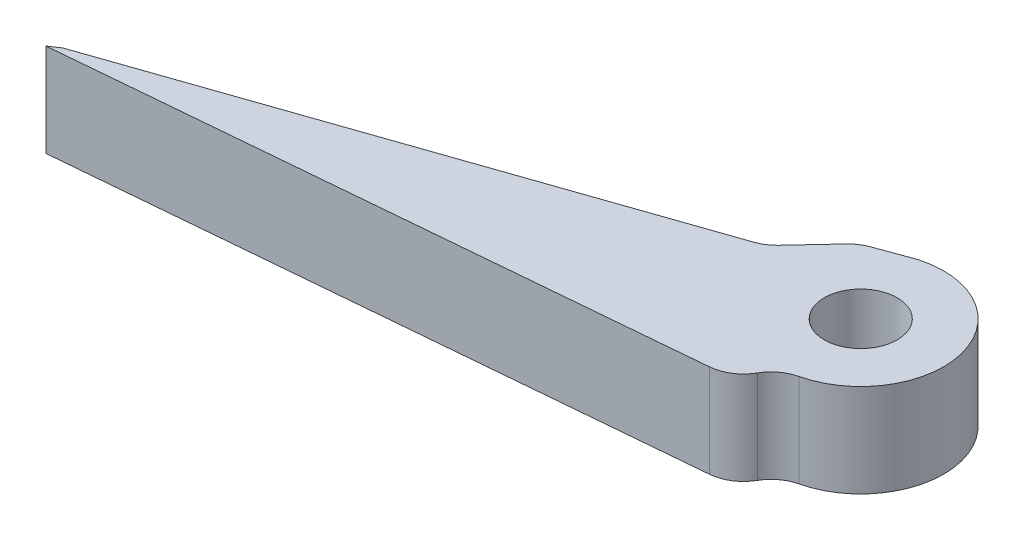
ISO-10303-21;
HEADER;
FILE_DESCRIPTION(('STEP AP214'),'2;1');
FILE_NAME('part.step','',(''),(''),'','','');
FILE_SCHEMA(('AUTOMOTIVE_DESIGN { 1 0 10303 214 1 1 1 1 }'));
ENDSEC;
DATA;
#1=APPLICATION_CONTEXT('core data for automotive mechanical design processes');
#2=APPLICATION_PROTOCOL_DEFINITION('international standard','automotive_design',2000,#1);
#3=PRODUCT_CONTEXT('',#1,'mechanical');
#4=PRODUCT('Part','Part','',(#3));
#5=PRODUCT_RELATED_PRODUCT_CATEGORY('part','',(#4));
#6=PRODUCT_DEFINITION_FORMATION('','',#4);
#7=PRODUCT_DEFINITION_CONTEXT('part definition',#1,'design');
#8=PRODUCT_DEFINITION('design','',#6,#7);
#9=PRODUCT_DEFINITION_SHAPE('','',#8);
#10=(LENGTH_UNIT() NAMED_UNIT(*) SI_UNIT(.MILLI.,.METRE.));
#11=(NAMED_UNIT(*) PLANE_ANGLE_UNIT() SI_UNIT($,.RADIAN.));
#12=(NAMED_UNIT(*) SI_UNIT($,.STERADIAN.) SOLID_ANGLE_UNIT());
#13=UNCERTAINTY_MEASURE_WITH_UNIT(LENGTH_MEASURE(1.E-05),#10,'distance_accuracy_value','');
#14=(GEOMETRIC_REPRESENTATION_CONTEXT(3) GLOBAL_UNCERTAINTY_ASSIGNED_CONTEXT((#13)) GLOBAL_UNIT_ASSIGNED_CONTEXT((#10,
#11,#12)) REPRESENTATION_CONTEXT('',''));
#15=CARTESIAN_POINT('',(0.,0.,0.));
#16=DIRECTION('',(0.,0.,1.));
#17=DIRECTION('',(1.,0.,0.));
#18=AXIS2_PLACEMENT_3D('',#15,#16,#17);
#19=CARTESIAN_POINT('',(0.,6.35,0.));
#20=DIRECTION('',(0.,-1.,0.));
#21=DIRECTION('',(0.,0.,-1.));
#22=AXIS2_PLACEMENT_3D('',#19,#20,#21);
#23=CYLINDRICAL_SURFACE('',#22,5.6642);
#24=CARTESIAN_POINT('',(0.,6.35,0.));
#25=DIRECTION('',(0.,1.,0.));
#26=DIRECTION('',(0.,0.,1.));
#27=AXIS2_PLACEMENT_3D('',#24,#25,#26);
#28=CIRCLE('',#27,5.6642);
#29=CARTESIAN_POINT('',(1.29689508505912,6.35,5.51373056816793));
#30=VERTEX_POINT('',#29);
#31=CARTESIAN_POINT('',(-1.48078407813982,6.35,-5.46721502722616));
#32=VERTEX_POINT('',#31);
#33=EDGE_CURVE('E189',#30,#32,#28,.T.);
#34=ORIENTED_EDGE('',*,*,#33,.F.);
#35=DIRECTION('',(0.,-1.,0.));
#36=VECTOR('',#35,1.);
#37=CARTESIAN_POINT('',(1.29689508505912,6.35,5.51373056816793));
#38=LINE('',#37,#36);
#39=CARTESIAN_POINT('',(1.29689508505912,0.,5.51373056816793));
#40=VERTEX_POINT('',#39);
#41=EDGE_CURVE('E239',#30,#40,#38,.T.);
#42=ORIENTED_EDGE('',*,*,#41,.T.);
#43=CARTESIAN_POINT('',(0.,0.,0.));
#44=DIRECTION('',(0.,1.,0.));
#45=DIRECTION('',(0.,0.,1.));
#46=AXIS2_PLACEMENT_3D('',#43,#44,#45);
#47=CIRCLE('',#46,5.6642);
#48=CARTESIAN_POINT('',(-1.48078407813982,0.,-5.46721502722616));
#49=VERTEX_POINT('',#48);
#50=EDGE_CURVE('E165',#40,#49,#47,.T.);
#51=ORIENTED_EDGE('',*,*,#50,.T.);
#52=DIRECTION('',(0.,-1.,0.));
#53=VECTOR('',#52,1.);
#54=CARTESIAN_POINT('',(-1.48078407813982,6.35,-5.46721502722616));
#55=LINE('',#54,#53);
#56=EDGE_CURVE('E220',#49,#32,#55,.F.);
#57=ORIENTED_EDGE('',*,*,#56,.T.);
#58=EDGE_LOOP('',(#34,#42,#51,#57));
#59=FACE_BOUND('',#58,.T.);
#60=ADVANCED_FACE('F41',(#59),#23,.T.);
#61=CARTESIAN_POINT('',(-1.93832585993717,6.35,-5.31007611663692));
#62=DIRECTION('',(0.342897302873058,0.,0.939372897034177));
#63=DIRECTION('',(0.939372897034177,0.,-0.342897302873058));
#64=AXIS2_PLACEMENT_3D('',#61,#62,#63);
#65=PLANE('',#64);
#66=DIRECTION('',(-0.939372897034177,0.,0.342897302873058));
#67=VECTOR('',#66,1.);
#68=CARTESIAN_POINT('',(-1.93832585993717,6.35,-5.31007611663692));
#69=LINE('',#68,#67);
#70=CARTESIAN_POINT('',(-1.68771449284554,6.35,-5.40155625420142));
#71=VERTEX_POINT('',#70);
#72=CARTESIAN_POINT('',(-3.93136501602205,6.35,-4.58256124655755));
#73=VERTEX_POINT('',#72);
#74=EDGE_CURVE('E260',#71,#73,#69,.T.);
#75=ORIENTED_EDGE('',*,*,#74,.F.);
#76=DIRECTION('',(0.,-1.,0.));
#77=VECTOR('',#76,1.);
#78=CARTESIAN_POINT('',(-1.68771449284554,6.35,-5.40155625420142));
#79=LINE('',#78,#77);
#80=CARTESIAN_POINT('',(-1.68771449284554,0.,-5.40155625420142));
#81=VERTEX_POINT('',#80);
#82=EDGE_CURVE('E216',#71,#81,#79,.T.);
#83=ORIENTED_EDGE('',*,*,#82,.T.);
#84=DIRECTION('',(-0.939372897034177,0.,0.342897302873058));
#85=VECTOR('',#84,1.);
#86=CARTESIAN_POINT('',(-1.93832585993717,0.,-5.31007611663692));
#87=LINE('',#86,#85);
#88=CARTESIAN_POINT('',(-3.93136501602205,0.,-4.58256124655755));
#89=VERTEX_POINT('',#88);
#90=EDGE_CURVE('E168',#81,#89,#87,.T.);
#91=ORIENTED_EDGE('',*,*,#90,.T.);
#92=DIRECTION('',(0.,-1.,0.));
#93=VECTOR('',#92,1.);
#94=CARTESIAN_POINT('',(-3.93136501602205,6.35,-4.58256124655755));
#95=LINE('',#94,#93);
#96=EDGE_CURVE('E213',#89,#73,#95,.F.);
#97=ORIENTED_EDGE('',*,*,#96,.T.);
#98=EDGE_LOOP('',(#75,#83,#91,#97));
#99=FACE_BOUND('',#98,.T.);
#100=ADVANCED_FACE('F263',(#99),#65,.F.);
#101=CARTESIAN_POINT('',(-4.58967507965529,6.35,-4.28088514702107));
#102=DIRECTION('',(0.731278684400195,0.,0.682078797311514));
#103=DIRECTION('',(0.682078797311514,0.,-0.731278684400195));
#104=AXIS2_PLACEMENT_3D('',#101,#102,#103);
#105=PLANE('',#104);
#106=DIRECTION('',(-0.682078797311514,0.,0.731278684400195));
#107=VECTOR('',#106,1.);
#108=CARTESIAN_POINT('',(-4.58967507965529,6.35,-4.28088514702107));
#109=LINE('',#108,#107);
#110=CARTESIAN_POINT('',(-4.91785372510097,6.35,-3.92903423326198));
#111=VERTEX_POINT('',#110);
#112=CARTESIAN_POINT('',(-7.13490656472734,6.35,-1.55206035546642));
#113=VERTEX_POINT('',#112);
#114=EDGE_CURVE('E138',#111,#113,#109,.T.);
#115=ORIENTED_EDGE('',*,*,#114,.F.);
#116=DIRECTION('',(0.,-1.,0.));
#117=VECTOR('',#116,1.);
#118=CARTESIAN_POINT('',(-4.91785372510097,6.35,-3.92903423326198));
#119=LINE('',#118,#117);
#120=CARTESIAN_POINT('',(-4.91785372510097,0.,-3.92903423326198));
#121=VERTEX_POINT('',#120);
#122=EDGE_CURVE('E227',#111,#121,#119,.T.);
#123=ORIENTED_EDGE('',*,*,#122,.T.);
#124=DIRECTION('',(-0.682078797311514,0.,0.731278684400195));
#125=VECTOR('',#124,1.);
#126=CARTESIAN_POINT('',(-4.58967507965529,0.,-4.28088514702107));
#127=LINE('',#126,#125);
#128=CARTESIAN_POINT('',(-7.13490656472734,0.,-1.55206035546642));
#129=VERTEX_POINT('',#128);
#130=EDGE_CURVE('E172',#121,#129,#127,.T.);
#131=ORIENTED_EDGE('',*,*,#130,.T.);
#132=DIRECTION('',(0.,-1.,0.));
#133=VECTOR('',#132,1.);
#134=CARTESIAN_POINT('',(-7.13490656472734,6.35,-1.55206035546642));
#135=LINE('',#134,#133);
#136=EDGE_CURVE('E224',#129,#113,#135,.F.);
#137=ORIENTED_EDGE('',*,*,#136,.T.);
#138=EDGE_LOOP('',(#115,#123,#131,#137));
#139=FACE_BOUND('',#138,.T.);
#140=ADVANCED_FACE('F292',(#139),#105,.F.);
#141=CARTESIAN_POINT('',(-1.14127849340694,6.35,-3.3070118596416));
#142=DIRECTION('',(0.326228149845985,0.,0.945291063243521));
#143=DIRECTION('',(0.945291063243521,0.,-0.326228149845985));
#144=AXIS2_PLACEMENT_3D('',#141,#142,#143);
#145=PLANE('',#144);
#146=DIRECTION('',(-0.945291063243521,0.,0.326228149845985));
#147=VECTOR('',#146,1.);
#148=CARTESIAN_POINT('',(-1.14127849340694,6.35,-3.3070118596416));
#149=LINE('',#148,#147);
#150=CARTESIAN_POINT('',(-8.16373492249503,6.35,-0.88350119999912));
#151=VERTEX_POINT('',#150);
#152=CARTESIAN_POINT('',(-43.2087752257035,6.35,11.2108463548856));
#153=VERTEX_POINT('',#152);
#154=EDGE_CURVE('E123',#151,#153,#149,.T.);
#155=ORIENTED_EDGE('',*,*,#154,.F.);
#156=DIRECTION('',(0.,-1.,0.));
#157=VECTOR('',#156,1.);
#158=CARTESIAN_POINT('',(-8.16373492249503,0.,-0.883501199999119));
#159=LINE('',#158,#157);
#160=CARTESIAN_POINT('',(-8.16373492249503,0.,-0.88350119999912));
#161=VERTEX_POINT('',#160);
#162=EDGE_CURVE('E231',#151,#161,#159,.T.);
#163=ORIENTED_EDGE('',*,*,#162,.T.);
#164=DIRECTION('',(-0.945291063243521,0.,0.326228149845985));
#165=VECTOR('',#164,1.);
#166=CARTESIAN_POINT('',(-1.14127849340694,0.,-3.3070118596416));
#167=LINE('',#166,#165);
#168=CARTESIAN_POINT('',(-43.2087752257035,0.,11.2108463548856));
#169=VERTEX_POINT('',#168);
#170=EDGE_CURVE('E144',#161,#169,#167,.T.);
#171=ORIENTED_EDGE('',*,*,#170,.T.);
#172=DIRECTION('',(0.,-1.,0.));
#173=VECTOR('',#172,1.);
#174=CARTESIAN_POINT('',(-43.2087752257035,6.35,11.2108463548856));
#175=LINE('',#174,#173);
#176=EDGE_CURVE('E141',#153,#169,#175,.T.);
#177=ORIENTED_EDGE('',*,*,#176,.F.);
#178=EDGE_LOOP('',(#155,#163,#171,#177));
#179=FACE_BOUND('',#178,.T.);
#180=ADVANCED_FACE('F142',(#179),#145,.F.);
#181=CARTESIAN_POINT('',(-8.12479474790291,6.35,-12.1842060856918));
#182=DIRECTION('',(0.554794299812511,0.,0.831987550925821));
#183=DIRECTION('',(0.831987550925821,0.,-0.554794299812511));
#184=AXIS2_PLACEMENT_3D('',#181,#182,#183);
#185=PLANE('',#184);
#186=DIRECTION('',(-0.831987550925821,0.,0.554794299812511));
#187=VECTOR('',#186,1.);
#188=CARTESIAN_POINT('',(-8.12479474790291,0.,-12.1842060856918));
#189=LINE('',#188,#187);
#190=CARTESIAN_POINT('',(-43.9079976591394,0.,11.6771088848232));
#191=VERTEX_POINT('',#190);
#192=EDGE_CURVE('E178',#169,#191,#189,.T.);
#193=ORIENTED_EDGE('',*,*,#192,.T.);
#194=DIRECTION('',(0.,-1.,0.));
#195=VECTOR('',#194,1.);
#196=CARTESIAN_POINT('',(-43.9079976591394,6.35,11.6771088848232));
#197=LINE('',#196,#195);
#198=CARTESIAN_POINT('',(-43.9079976591394,6.35,11.6771088848232));
#199=VERTEX_POINT('',#198);
#200=EDGE_CURVE('E149',#199,#191,#197,.T.);
#201=ORIENTED_EDGE('',*,*,#200,.F.);
#202=DIRECTION('',(-0.831987550925821,0.,0.554794299812511));
#203=VECTOR('',#202,1.);
#204=CARTESIAN_POINT('',(-8.12479474790291,6.35,-12.1842060856918));
#205=LINE('',#204,#203);
#206=EDGE_CURVE('E129',#153,#199,#205,.T.);
#207=ORIENTED_EDGE('',*,*,#206,.F.);
#208=ORIENTED_EDGE('',*,*,#176,.T.);
#209=EDGE_LOOP('',(#193,#201,#207,#208));
#210=FACE_BOUND('',#209,.T.);
#211=ADVANCED_FACE('F151',(#210),#185,.F.);
#212=CARTESIAN_POINT('',(0.684121339297338,6.35,7.73125035187185));
#213=DIRECTION('',(-0.0881433880829443,0.,-0.996107796946324));
#214=DIRECTION('',(-0.996107796946324,0.,0.0881433880829443));
#215=AXIS2_PLACEMENT_3D('',#212,#213,#214);
#216=PLANE('',#215);
#217=DIRECTION('',(0.996107796946324,0.,-0.0881433880829443));
#218=VECTOR('',#217,1.);
#219=CARTESIAN_POINT('',(0.684121339297338,0.,7.73125035187185));
#220=LINE('',#219,#218);
#221=CARTESIAN_POINT('',(-2.30836599064848,0.,7.99604897393396));
#222=VERTEX_POINT('',#221);
#223=EDGE_CURVE('E181',#191,#222,#220,.T.);
#224=ORIENTED_EDGE('',*,*,#223,.T.);
#225=DIRECTION('',(0.,-1.,0.));
#226=VECTOR('',#225,1.);
#227=CARTESIAN_POINT('',(-2.30836599064848,6.35,7.99604897393396));
#228=LINE('',#227,#226);
#229=CARTESIAN_POINT('',(-2.30836599064848,6.35,7.99604897393396));
#230=VERTEX_POINT('',#229);
#231=EDGE_CURVE('E201',#222,#230,#228,.F.);
#232=ORIENTED_EDGE('',*,*,#231,.T.);
#233=DIRECTION('',(0.996107796946324,0.,-0.0881433880829443));
#234=VECTOR('',#233,1.);
#235=CARTESIAN_POINT('',(0.684121339297338,6.35,7.73125035187185));
#236=LINE('',#235,#234);
#237=EDGE_CURVE('E155',#199,#230,#236,.T.);
#238=ORIENTED_EDGE('',*,*,#237,.F.);
#239=ORIENTED_EDGE('',*,*,#200,.T.);
#240=EDGE_LOOP('',(#224,#232,#238,#239));
#241=FACE_BOUND('',#240,.T.);
#242=ADVANCED_FACE('F279',(#241),#216,.F.);
#243=CARTESIAN_POINT('',(0.,6.35,0.));
#244=DIRECTION('',(0.,-1.,0.));
#245=DIRECTION('',(0.,0.,-1.));
#246=AXIS2_PLACEMENT_3D('',#243,#244,#245);
#247=CYLINDRICAL_SURFACE('',#246,2.4892);
#248=CARTESIAN_POINT('',(0.,6.35,0.));
#249=DIRECTION('',(0.,1.,0.));
#250=DIRECTION('',(0.,0.,1.));
#251=AXIS2_PLACEMENT_3D('',#248,#249,#250);
#252=CIRCLE('',#251,2.4892);
#253=CARTESIAN_POINT('',(0.,6.35,2.4892));
#254=VERTEX_POINT('',#253);
#255=EDGE_CURVE('E158',#254,#254,#252,.T.);
#256=ORIENTED_EDGE('',*,*,#255,.T.);
#257=EDGE_LOOP('',(#256));
#258=FACE_BOUND('',#257,.T.);
#259=CARTESIAN_POINT('',(0.,0.,0.));
#260=DIRECTION('',(0.,1.,0.));
#261=DIRECTION('',(0.,0.,1.));
#262=AXIS2_PLACEMENT_3D('',#259,#260,#261);
#263=CIRCLE('',#262,2.4892);
#264=CARTESIAN_POINT('',(0.,0.,2.4892));
#265=VERTEX_POINT('',#264);
#266=EDGE_CURVE('E185',#265,#265,#263,.T.);
#267=ORIENTED_EDGE('',*,*,#266,.F.);
#268=EDGE_LOOP('',(#267));
#269=FACE_BOUND('',#268,.T.);
#270=ADVANCED_FACE('F314',(#258,#269),#247,.F.);
#271=CARTESIAN_POINT('',(0.,6.35,0.));
#272=DIRECTION('',(0.,1.,0.));
#273=DIRECTION('',(0.,0.,1.));
#274=AXIS2_PLACEMENT_3D('',#271,#272,#273);
#275=PLANE('',#274);
#276=ORIENTED_EDGE('',*,*,#237,.T.);
#277=CARTESIAN_POINT('',(-2.53225019637915,6.35,5.46593516969029));
#278=DIRECTION('',(0.,1.,0.));
#279=DIRECTION('',(0.,0.,1.));
#280=AXIS2_PLACEMENT_3D('',#277,#278,#279);
#281=CIRCLE('',#280,2.54);
#282=CARTESIAN_POINT('',(-0.326893904301469,6.35,6.72609532815959));
#283=VERTEX_POINT('',#282);
#284=EDGE_CURVE('E210',#230,#283,#281,.T.);
#285=ORIENTED_EDGE('',*,*,#284,.T.);
#286=CARTESIAN_POINT('',(1.87846238777622,6.35,7.98625548662889));
#287=DIRECTION('',(0.,1.,0.));
#288=DIRECTION('',(0.,0.,1.));
#289=AXIS2_PLACEMENT_3D('',#286,#287,#288);
#290=CIRCLE('',#289,2.54);
#291=EDGE_CURVE('E11',#283,#30,#290,.F.);
#292=ORIENTED_EDGE('',*,*,#291,.T.);
#293=ORIENTED_EDGE('',*,*,#33,.T.);
#294=CARTESIAN_POINT('',(-0.816755343547975,6.35,-3.01554909573461));
#295=DIRECTION('',(0.,1.,0.));
#296=DIRECTION('',(0.,0.,1.));
#297=AXIS2_PLACEMENT_3D('',#294,#295,#296);
#298=CIRCLE('',#297,2.54);
#299=EDGE_CURVE('E207',#32,#71,#298,.T.);
#300=ORIENTED_EDGE('',*,*,#299,.T.);
#301=ORIENTED_EDGE('',*,*,#74,.T.);
#302=CARTESIAN_POINT('',(-3.06040586672448,6.35,-2.19655408809074));
#303=DIRECTION('',(0.,1.,0.));
#304=DIRECTION('',(0.,0.,1.));
#305=AXIS2_PLACEMENT_3D('',#302,#303,#304);
#306=CIRCLE('',#305,2.54);
#307=EDGE_CURVE('E204',#73,#111,#306,.T.);
#308=ORIENTED_EDGE('',*,*,#307,.T.);
#309=ORIENTED_EDGE('',*,*,#114,.T.);
#310=CARTESIAN_POINT('',(-8.99235442310383,6.35,-3.28454050063766));
#311=DIRECTION('',(0.,1.,0.));
#312=DIRECTION('',(0.,0.,1.));
#313=AXIS2_PLACEMENT_3D('',#310,#311,#312);
#314=CIRCLE('',#313,2.54);
#315=EDGE_CURVE('E133',#113,#151,#314,.F.);
#316=ORIENTED_EDGE('',*,*,#315,.T.);
#317=ORIENTED_EDGE('',*,*,#154,.T.);
#318=ORIENTED_EDGE('',*,*,#206,.T.);
#319=EDGE_LOOP('',(#276,#285,#292,#293,#300,#301,#308,#309,#316,#317,#318));
#320=FACE_BOUND('',#319,.T.);
#321=ORIENTED_EDGE('',*,*,#255,.F.);
#322=EDGE_LOOP('',(#321));
#323=FACE_BOUND('',#322,.T.);
#324=ADVANCED_FACE('F126',(#320,#323),#275,.T.);
#325=CARTESIAN_POINT('',(0.,0.,0.));
#326=DIRECTION('',(0.,1.,0.));
#327=DIRECTION('',(0.,0.,1.));
#328=AXIS2_PLACEMENT_3D('',#325,#326,#327);
#329=PLANE('',#328);
#330=ORIENTED_EDGE('',*,*,#50,.F.);
#331=CARTESIAN_POINT('',(1.87846238777622,0.,7.98625548662889));
#332=DIRECTION('',(0.,1.,0.));
#333=DIRECTION('',(0.,0.,1.));
#334=AXIS2_PLACEMENT_3D('',#331,#332,#333);
#335=CIRCLE('',#334,2.54);
#336=CARTESIAN_POINT('',(-0.326893904301469,0.,6.72609532815959));
#337=VERTEX_POINT('',#336);
#338=EDGE_CURVE('E50',#40,#337,#335,.T.);
#339=ORIENTED_EDGE('',*,*,#338,.T.);
#340=CARTESIAN_POINT('',(-2.53225019637915,0.,5.46593516969029));
#341=DIRECTION('',(0.,1.,0.));
#342=DIRECTION('',(0.,0.,1.));
#343=AXIS2_PLACEMENT_3D('',#340,#341,#342);
#344=CIRCLE('',#343,2.54);
#345=EDGE_CURVE('E198',#337,#222,#344,.F.);
#346=ORIENTED_EDGE('',*,*,#345,.T.);
#347=ORIENTED_EDGE('',*,*,#223,.F.);
#348=ORIENTED_EDGE('',*,*,#192,.F.);
#349=ORIENTED_EDGE('',*,*,#170,.F.);
#350=CARTESIAN_POINT('',(-8.99235442310383,0.,-3.28454050063766));
#351=DIRECTION('',(0.,1.,0.));
#352=DIRECTION('',(0.,0.,1.));
#353=AXIS2_PLACEMENT_3D('',#350,#351,#352);
#354=CIRCLE('',#353,2.54);
#355=EDGE_CURVE('E234',#161,#129,#354,.T.);
#356=ORIENTED_EDGE('',*,*,#355,.T.);
#357=ORIENTED_EDGE('',*,*,#130,.F.);
#358=CARTESIAN_POINT('',(-3.06040586672448,0.,-2.19655408809074));
#359=DIRECTION('',(0.,1.,0.));
#360=DIRECTION('',(0.,0.,1.));
#361=AXIS2_PLACEMENT_3D('',#358,#359,#360);
#362=CIRCLE('',#361,2.54);
#363=EDGE_CURVE('E148',#121,#89,#362,.F.);
#364=ORIENTED_EDGE('',*,*,#363,.T.);
#365=ORIENTED_EDGE('',*,*,#90,.F.);
#366=CARTESIAN_POINT('',(-0.816755343547975,0.,-3.01554909573461));
#367=DIRECTION('',(0.,1.,0.));
#368=DIRECTION('',(0.,0.,1.));
#369=AXIS2_PLACEMENT_3D('',#366,#367,#368);
#370=CIRCLE('',#369,2.54);
#371=EDGE_CURVE('E194',#81,#49,#370,.F.);
#372=ORIENTED_EDGE('',*,*,#371,.T.);
#373=EDGE_LOOP('',(#330,#339,#346,#347,#348,#349,#356,#357,#364,#365,#372));
#374=FACE_BOUND('',#373,.T.);
#375=ORIENTED_EDGE('',*,*,#266,.T.);
#376=EDGE_LOOP('',(#375));
#377=FACE_BOUND('',#376,.T.);
#378=ADVANCED_FACE('F250',(#374,#377),#329,.F.);
#379=CARTESIAN_POINT('',(-2.53225019637915,6.35,5.46593516969029));
#380=DIRECTION('',(0.,-1.,0.));
#381=DIRECTION('',(0.,0.,-1.));
#382=AXIS2_PLACEMENT_3D('',#379,#380,#381);
#383=CYLINDRICAL_SURFACE('',#382,2.54);
#384=ORIENTED_EDGE('',*,*,#345,.F.);
#385=DIRECTION('',(0.,-1.,0.));
#386=VECTOR('',#385,1.);
#387=CARTESIAN_POINT('',(-0.326893904301469,6.35,6.72609532815959));
#388=LINE('',#387,#386);
#389=EDGE_CURVE('E63',#337,#283,#388,.F.);
#390=ORIENTED_EDGE('',*,*,#389,.T.);
#391=ORIENTED_EDGE('',*,*,#284,.F.);
#392=ORIENTED_EDGE('',*,*,#231,.F.);
#393=EDGE_LOOP('',(#384,#390,#391,#392));
#394=FACE_BOUND('',#393,.T.);
#395=ADVANCED_FACE('F281',(#394),#383,.T.);
#396=CARTESIAN_POINT('',(-0.816755343547975,6.35,-3.01554909573461));
#397=DIRECTION('',(0.,-1.,0.));
#398=DIRECTION('',(0.,0.,-1.));
#399=AXIS2_PLACEMENT_3D('',#396,#397,#398);
#400=CYLINDRICAL_SURFACE('',#399,2.54);
#401=ORIENTED_EDGE('',*,*,#299,.F.);
#402=ORIENTED_EDGE('',*,*,#56,.F.);
#403=ORIENTED_EDGE('',*,*,#371,.F.);
#404=ORIENTED_EDGE('',*,*,#82,.F.);
#405=EDGE_LOOP('',(#401,#402,#403,#404));
#406=FACE_BOUND('',#405,.T.);
#407=ADVANCED_FACE('F257',(#406),#400,.T.);
#408=CARTESIAN_POINT('',(-3.06040586672448,6.35,-2.19655408809074));
#409=DIRECTION('',(0.,-1.,0.));
#410=DIRECTION('',(0.,0.,-1.));
#411=AXIS2_PLACEMENT_3D('',#408,#409,#410);
#412=CYLINDRICAL_SURFACE('',#411,2.54);
#413=ORIENTED_EDGE('',*,*,#307,.F.);
#414=ORIENTED_EDGE('',*,*,#96,.F.);
#415=ORIENTED_EDGE('',*,*,#363,.F.);
#416=ORIENTED_EDGE('',*,*,#122,.F.);
#417=EDGE_LOOP('',(#413,#414,#415,#416));
#418=FACE_BOUND('',#417,.T.);
#419=ADVANCED_FACE('F286',(#418),#412,.T.);
#420=CARTESIAN_POINT('',(-8.99235442310383,6.35,-3.28454050063766));
#421=DIRECTION('',(0.,1.,0.));
#422=DIRECTION('',(0.,0.,1.));
#423=AXIS2_PLACEMENT_3D('',#420,#421,#422);
#424=CYLINDRICAL_SURFACE('',#423,2.54);
#425=ORIENTED_EDGE('',*,*,#315,.F.);
#426=ORIENTED_EDGE('',*,*,#136,.F.);
#427=ORIENTED_EDGE('',*,*,#355,.F.);
#428=ORIENTED_EDGE('',*,*,#162,.F.);
#429=EDGE_LOOP('',(#425,#426,#427,#428));
#430=FACE_BOUND('',#429,.T.);
#431=ADVANCED_FACE('F275',(#430),#424,.F.);
#432=CARTESIAN_POINT('',(1.87846238777622,6.35,7.98625548662889));
#433=DIRECTION('',(0.,1.,0.));
#434=DIRECTION('',(0.,0.,1.));
#435=AXIS2_PLACEMENT_3D('',#432,#433,#434);
#436=CYLINDRICAL_SURFACE('',#435,2.54);
#437=ORIENTED_EDGE('',*,*,#291,.F.);
#438=ORIENTED_EDGE('',*,*,#389,.F.);
#439=ORIENTED_EDGE('',*,*,#338,.F.);
#440=ORIENTED_EDGE('',*,*,#41,.F.);
#441=EDGE_LOOP('',(#437,#438,#439,#440));
#442=FACE_BOUND('',#441,.T.);
#443=ADVANCED_FACE('F43',(#442),#436,.F.);
#444=CLOSED_SHELL('',(#60,#100,#140,#180,#211,#242,#270,#324,#378,#395,#407,#419,#431,#443));
#445=MANIFOLD_SOLID_BREP('B2',#444);
#446=ADVANCED_BREP_SHAPE_REPRESENTATION('',(#18,#445),#14);
#447=SHAPE_DEFINITION_REPRESENTATION(#9,#446);
ENDSEC;
END-ISO-10303-21;
